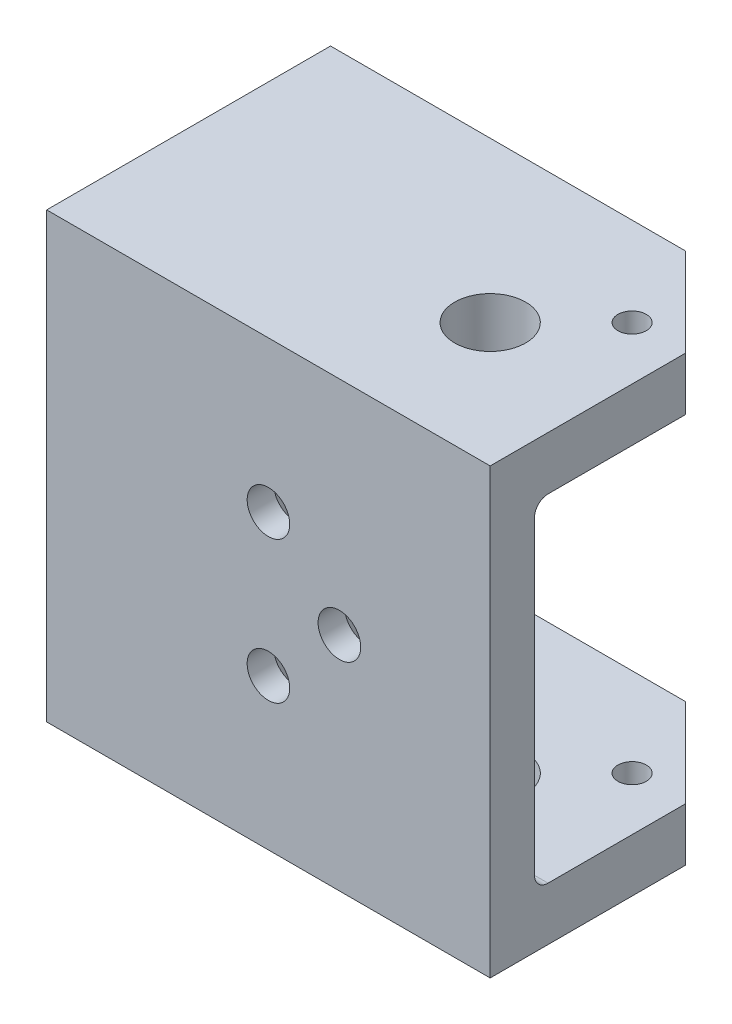
ISO-10303-21;
HEADER;
FILE_DESCRIPTION(('STEP AP214'),'2;1');
FILE_NAME('part.step','',(''),(''),'','','');
FILE_SCHEMA(('AUTOMOTIVE_DESIGN { 1 0 10303 214 1 1 1 1 }'));
ENDSEC;
DATA;
#1=APPLICATION_CONTEXT('core data for automotive mechanical design processes');
#2=APPLICATION_PROTOCOL_DEFINITION('international standard','automotive_design',2000,#1);
#3=PRODUCT_CONTEXT('',#1,'mechanical');
#4=PRODUCT('Part','Part','',(#3));
#5=PRODUCT_RELATED_PRODUCT_CATEGORY('part','',(#4));
#6=PRODUCT_DEFINITION_FORMATION('','',#4);
#7=PRODUCT_DEFINITION_CONTEXT('part definition',#1,'design');
#8=PRODUCT_DEFINITION('design','',#6,#7);
#9=PRODUCT_DEFINITION_SHAPE('','',#8);
#10=(LENGTH_UNIT() NAMED_UNIT(*) SI_UNIT(.MILLI.,.METRE.));
#11=(NAMED_UNIT(*) PLANE_ANGLE_UNIT() SI_UNIT($,.RADIAN.));
#12=(NAMED_UNIT(*) SI_UNIT($,.STERADIAN.) SOLID_ANGLE_UNIT());
#13=UNCERTAINTY_MEASURE_WITH_UNIT(LENGTH_MEASURE(1.E-05),#10,'distance_accuracy_value','');
#14=(GEOMETRIC_REPRESENTATION_CONTEXT(3) GLOBAL_UNCERTAINTY_ASSIGNED_CONTEXT((#13)) GLOBAL_UNIT_ASSIGNED_CONTEXT((#10,
#11,#12)) REPRESENTATION_CONTEXT('',''));
#15=CARTESIAN_POINT('',(0.,0.,0.));
#16=DIRECTION('',(0.,0.,1.));
#17=DIRECTION('',(1.,0.,0.));
#18=AXIS2_PLACEMENT_3D('',#15,#16,#17);
#19=CARTESIAN_POINT('',(0.,0.,0.));
#20=DIRECTION('',(0.,0.,1.));
#21=DIRECTION('',(1.,0.,0.));
#22=AXIS2_PLACEMENT_3D('',#19,#20,#21);
#23=PLANE('',#22);
#24=CARTESIAN_POINT('',(0.,4.,0.));
#25=DIRECTION('',(0.,0.,-1.));
#26=DIRECTION('',(-1.,0.,0.));
#27=AXIS2_PLACEMENT_3D('',#24,#25,#26);
#28=CIRCLE('',#27,2.2);
#29=CARTESIAN_POINT('',(-2.2,4.,0.));
#30=VERTEX_POINT('',#29);
#31=EDGE_CURVE('E294',#30,#30,#28,.T.);
#32=ORIENTED_EDGE('',*,*,#31,.F.);
#33=EDGE_LOOP('',(#32));
#34=FACE_BOUND('',#33,.T.);
#35=CARTESIAN_POINT('',(0.,-4.,0.));
#36=DIRECTION('',(0.,0.,-1.));
#37=DIRECTION('',(-1.,0.,0.));
#38=AXIS2_PLACEMENT_3D('',#35,#36,#37);
#39=CIRCLE('',#38,2.2);
#40=CARTESIAN_POINT('',(-2.2,-4.,0.));
#41=VERTEX_POINT('',#40);
#42=EDGE_CURVE('E285',#41,#41,#39,.T.);
#43=ORIENTED_EDGE('',*,*,#42,.F.);
#44=EDGE_LOOP('',(#43));
#45=FACE_BOUND('',#44,.T.);
#46=CARTESIAN_POINT('',(4.,0.,0.));
#47=DIRECTION('',(0.,0.,-1.));
#48=DIRECTION('',(-1.,0.,0.));
#49=AXIS2_PLACEMENT_3D('',#46,#47,#48);
#50=CIRCLE('',#49,2.2);
#51=CARTESIAN_POINT('',(1.8,0.,0.));
#52=VERTEX_POINT('',#51);
#53=EDGE_CURVE('E276',#52,#52,#50,.T.);
#54=ORIENTED_EDGE('',*,*,#53,.F.);
#55=EDGE_LOOP('',(#54));
#56=FACE_BOUND('',#55,.T.);
#57=DIRECTION('',(0.,-1.,0.));
#58=VECTOR('',#57,1.);
#59=CARTESIAN_POINT('',(-12.5,12.5,0.));
#60=LINE('',#59,#58);
#61=CARTESIAN_POINT('',(-12.5,8.738,0.));
#62=VERTEX_POINT('',#61);
#63=CARTESIAN_POINT('',(-12.5,-8.738,0.));
#64=VERTEX_POINT('',#63);
#65=EDGE_CURVE('E175',#62,#64,#60,.T.);
#66=ORIENTED_EDGE('',*,*,#65,.F.);
#67=DIRECTION('',(-1.,0.,0.));
#68=VECTOR('',#67,1.);
#69=CARTESIAN_POINT('',(12.5,8.738,0.));
#70=LINE('',#69,#68);
#71=CARTESIAN_POINT('',(12.5,8.738,0.));
#72=VERTEX_POINT('',#71);
#73=EDGE_CURVE('E207',#62,#72,#70,.F.);
#74=ORIENTED_EDGE('',*,*,#73,.T.);
#75=DIRECTION('',(0.,1.,0.));
#76=VECTOR('',#75,1.);
#77=CARTESIAN_POINT('',(12.5,12.5,0.));
#78=LINE('',#77,#76);
#79=CARTESIAN_POINT('',(12.5,-8.73800000000001,0.));
#80=VERTEX_POINT('',#79);
#81=EDGE_CURVE('E170',#80,#72,#78,.T.);
#82=ORIENTED_EDGE('',*,*,#81,.F.);
#83=DIRECTION('',(1.,0.,0.));
#84=VECTOR('',#83,1.);
#85=CARTESIAN_POINT('',(-12.5,-8.738,0.));
#86=LINE('',#85,#84);
#87=EDGE_CURVE('E205',#80,#64,#86,.F.);
#88=ORIENTED_EDGE('',*,*,#87,.T.);
#89=EDGE_LOOP('',(#66,#74,#82,#88));
#90=FACE_BOUND('',#89,.T.);
#91=ADVANCED_FACE('F35',(#34,#45,#56,#90),#23,.F.);
#92=CARTESIAN_POINT('',(12.5,12.5,2.5));
#93=DIRECTION('',(-1.,0.,0.));
#94=DIRECTION('',(0.,-1.,0.));
#95=AXIS2_PLACEMENT_3D('',#92,#93,#94);
#96=PLANE('',#95);
#97=DIRECTION('',(0.,0.,-1.));
#98=VECTOR('',#97,1.);
#99=CARTESIAN_POINT('',(12.5,-12.5,2.5));
#100=LINE('',#99,#98);
#101=CARTESIAN_POINT('',(12.5,-12.5,2.5));
#102=VERTEX_POINT('',#101);
#103=CARTESIAN_POINT('',(12.5,-12.5,-8.49999999999998));
#104=VERTEX_POINT('',#103);
#105=EDGE_CURVE('E181',#102,#104,#100,.T.);
#106=ORIENTED_EDGE('',*,*,#105,.T.);
#107=DIRECTION('',(0.,1.,0.));
#108=VECTOR('',#107,1.);
#109=CARTESIAN_POINT('',(12.5,-9.50000000000001,-8.49999999999998));
#110=LINE('',#109,#108);
#111=CARTESIAN_POINT('',(12.5,-9.50000000000001,-8.49999999999998));
#112=VERTEX_POINT('',#111);
#113=EDGE_CURVE('E225',#104,#112,#110,.T.);
#114=ORIENTED_EDGE('',*,*,#113,.T.);
#115=DIRECTION('',(0.,0.,1.));
#116=VECTOR('',#115,1.);
#117=CARTESIAN_POINT('',(12.5,-9.50000000000001,-13.5));
#118=LINE('',#117,#116);
#119=CARTESIAN_POINT('',(12.5,-9.50000000000001,-0.762000000000001));
#120=VERTEX_POINT('',#119);
#121=EDGE_CURVE('E154',#112,#120,#118,.T.);
#122=ORIENTED_EDGE('',*,*,#121,.T.);
#123=CARTESIAN_POINT('',(12.5,-8.738,-0.762000000000001));
#124=DIRECTION('',(-1.,0.,0.));
#125=DIRECTION('',(0.,-1.,0.));
#126=AXIS2_PLACEMENT_3D('',#123,#124,#125);
#127=CIRCLE('',#126,0.762);
#128=EDGE_CURVE('E216',#120,#80,#127,.T.);
#129=ORIENTED_EDGE('',*,*,#128,.T.);
#130=ORIENTED_EDGE('',*,*,#81,.T.);
#131=CARTESIAN_POINT('',(12.5,8.738,-0.762000000000001));
#132=DIRECTION('',(-1.,0.,0.));
#133=DIRECTION('',(0.,-1.,0.));
#134=AXIS2_PLACEMENT_3D('',#131,#132,#133);
#135=CIRCLE('',#134,0.762);
#136=CARTESIAN_POINT('',(12.5,9.5,-0.762000000000001));
#137=VERTEX_POINT('',#136);
#138=EDGE_CURVE('E213',#72,#137,#135,.T.);
#139=ORIENTED_EDGE('',*,*,#138,.T.);
#140=DIRECTION('',(0.,0.,1.));
#141=VECTOR('',#140,1.);
#142=CARTESIAN_POINT('',(12.5,9.5,-13.5));
#143=LINE('',#142,#141);
#144=CARTESIAN_POINT('',(12.5,9.5,-8.49999999999998));
#145=VERTEX_POINT('',#144);
#146=EDGE_CURVE('E168',#145,#137,#143,.T.);
#147=ORIENTED_EDGE('',*,*,#146,.F.);
#148=DIRECTION('',(0.,1.,0.));
#149=VECTOR('',#148,1.);
#150=CARTESIAN_POINT('',(12.5,12.5,-8.49999999999998));
#151=LINE('',#150,#149);
#152=CARTESIAN_POINT('',(12.5,12.5,-8.49999999999998));
#153=VERTEX_POINT('',#152);
#154=EDGE_CURVE('E223',#145,#153,#151,.T.);
#155=ORIENTED_EDGE('',*,*,#154,.T.);
#156=DIRECTION('',(0.,0.,-1.));
#157=VECTOR('',#156,1.);
#158=CARTESIAN_POINT('',(12.5,12.5,2.5));
#159=LINE('',#158,#157);
#160=CARTESIAN_POINT('',(12.5,12.5,2.5));
#161=VERTEX_POINT('',#160);
#162=EDGE_CURVE('E191',#161,#153,#159,.T.);
#163=ORIENTED_EDGE('',*,*,#162,.F.);
#164=DIRECTION('',(0.,1.,0.));
#165=VECTOR('',#164,1.);
#166=CARTESIAN_POINT('',(12.5,12.5,2.5));
#167=LINE('',#166,#165);
#168=EDGE_CURVE('E171',#102,#161,#167,.T.);
#169=ORIENTED_EDGE('',*,*,#168,.F.);
#170=EDGE_LOOP('',(#106,#114,#122,#129,#130,#139,#147,#155,#163,#169));
#171=FACE_BOUND('',#170,.T.);
#172=ADVANCED_FACE('F235',(#171),#96,.F.);
#173=CARTESIAN_POINT('',(-12.5,12.5,2.5));
#174=DIRECTION('',(0.,-1.,0.));
#175=DIRECTION('',(0.,0.,-1.));
#176=AXIS2_PLACEMENT_3D('',#173,#174,#175);
#177=PLANE('',#176);
#178=CARTESIAN_POINT('',(9.5,12.5,-8.5));
#179=DIRECTION('',(0.,-1.,0.));
#180=DIRECTION('',(0.,0.,-1.));
#181=AXIS2_PLACEMENT_3D('',#178,#179,#180);
#182=CIRCLE('',#181,0.800000000000001);
#183=CARTESIAN_POINT('',(9.5,12.5,-9.3));
#184=VERTEX_POINT('',#183);
#185=EDGE_CURVE('E202',#184,#184,#182,.T.);
#186=ORIENTED_EDGE('',*,*,#185,.T.);
#187=EDGE_LOOP('',(#186));
#188=FACE_BOUND('',#187,.T.);
#189=CARTESIAN_POINT('',(5.5,12.5,-4.5));
#190=DIRECTION('',(0.,-1.,0.));
#191=DIRECTION('',(0.,0.,-1.));
#192=AXIS2_PLACEMENT_3D('',#189,#190,#191);
#193=CIRCLE('',#192,2.);
#194=CARTESIAN_POINT('',(5.5,12.5,-6.5));
#195=VERTEX_POINT('',#194);
#196=EDGE_CURVE('E197',#195,#195,#193,.T.);
#197=ORIENTED_EDGE('',*,*,#196,.T.);
#198=EDGE_LOOP('',(#197));
#199=FACE_BOUND('',#198,.T.);
#200=ORIENTED_EDGE('',*,*,#162,.T.);
#201=DIRECTION('',(0.707106781186546,0.,0.707106781186549));
#202=VECTOR('',#201,1.);
#203=CARTESIAN_POINT('',(7.49999999999999,12.5,-13.5));
#204=LINE('',#203,#202);
#205=CARTESIAN_POINT('',(7.49999999999999,12.5,-13.5));
#206=VERTEX_POINT('',#205);
#207=EDGE_CURVE('E11',#153,#206,#204,.F.);
#208=ORIENTED_EDGE('',*,*,#207,.T.);
#209=DIRECTION('',(1.,0.,0.));
#210=VECTOR('',#209,1.);
#211=CARTESIAN_POINT('',(-12.5,12.5,-13.5));
#212=LINE('',#211,#210);
#213=CARTESIAN_POINT('',(-12.5,12.5,-13.5));
#214=VERTEX_POINT('',#213);
#215=EDGE_CURVE('E157',#214,#206,#212,.T.);
#216=ORIENTED_EDGE('',*,*,#215,.F.);
#217=DIRECTION('',(0.,0.,-1.));
#218=VECTOR('',#217,1.);
#219=CARTESIAN_POINT('',(-12.5,12.5,2.5));
#220=LINE('',#219,#218);
#221=CARTESIAN_POINT('',(-12.5,12.5,2.5));
#222=VERTEX_POINT('',#221);
#223=EDGE_CURVE('E189',#222,#214,#220,.T.);
#224=ORIENTED_EDGE('',*,*,#223,.F.);
#225=DIRECTION('',(-1.,0.,0.));
#226=VECTOR('',#225,1.);
#227=CARTESIAN_POINT('',(-12.5,12.5,2.5));
#228=LINE('',#227,#226);
#229=EDGE_CURVE('E174',#161,#222,#228,.T.);
#230=ORIENTED_EDGE('',*,*,#229,.F.);
#231=EDGE_LOOP('',(#200,#208,#216,#224,#230));
#232=FACE_BOUND('',#231,.T.);
#233=ADVANCED_FACE('F243',(#188,#199,#232),#177,.F.);
#234=CARTESIAN_POINT('',(-12.5,12.5,2.5));
#235=DIRECTION('',(1.,0.,0.));
#236=DIRECTION('',(0.,1.,0.));
#237=AXIS2_PLACEMENT_3D('',#234,#235,#236);
#238=PLANE('',#237);
#239=ORIENTED_EDGE('',*,*,#223,.T.);
#240=DIRECTION('',(0.,1.,0.));
#241=VECTOR('',#240,1.);
#242=CARTESIAN_POINT('',(-12.5,12.5,-13.5));
#243=LINE('',#242,#241);
#244=CARTESIAN_POINT('',(-12.5,9.5,-13.5));
#245=VERTEX_POINT('',#244);
#246=EDGE_CURVE('E153',#245,#214,#243,.T.);
#247=ORIENTED_EDGE('',*,*,#246,.F.);
#248=DIRECTION('',(0.,0.,1.));
#249=VECTOR('',#248,1.);
#250=CARTESIAN_POINT('',(-12.5,9.5,-13.5));
#251=LINE('',#250,#249);
#252=CARTESIAN_POINT('',(-12.5,9.5,-0.762000000000001));
#253=VERTEX_POINT('',#252);
#254=EDGE_CURVE('E165',#245,#253,#251,.T.);
#255=ORIENTED_EDGE('',*,*,#254,.T.);
#256=CARTESIAN_POINT('',(-12.5,8.738,-0.762000000000001));
#257=DIRECTION('',(1.,0.,0.));
#258=DIRECTION('',(0.,1.,0.));
#259=AXIS2_PLACEMENT_3D('',#256,#257,#258);
#260=CIRCLE('',#259,0.762);
#261=EDGE_CURVE('E211',#253,#62,#260,.T.);
#262=ORIENTED_EDGE('',*,*,#261,.T.);
#263=ORIENTED_EDGE('',*,*,#65,.T.);
#264=CARTESIAN_POINT('',(-12.5,-8.738,-0.762000000000001));
#265=DIRECTION('',(1.,0.,0.));
#266=DIRECTION('',(0.,1.,0.));
#267=AXIS2_PLACEMENT_3D('',#264,#265,#266);
#268=CIRCLE('',#267,0.762);
#269=CARTESIAN_POINT('',(-12.5,-9.5,-0.762000000000001));
#270=VERTEX_POINT('',#269);
#271=EDGE_CURVE('E152',#64,#270,#268,.T.);
#272=ORIENTED_EDGE('',*,*,#271,.T.);
#273=DIRECTION('',(0.,0.,1.));
#274=VECTOR('',#273,1.);
#275=CARTESIAN_POINT('',(-12.5,-9.5,-13.5));
#276=LINE('',#275,#274);
#277=CARTESIAN_POINT('',(-12.5,-9.5,-13.5));
#278=VERTEX_POINT('',#277);
#279=EDGE_CURVE('E131',#278,#270,#276,.T.);
#280=ORIENTED_EDGE('',*,*,#279,.F.);
#281=DIRECTION('',(0.,1.,0.));
#282=VECTOR('',#281,1.);
#283=CARTESIAN_POINT('',(-12.5,-12.5,-13.5));
#284=LINE('',#283,#282);
#285=CARTESIAN_POINT('',(-12.5,-12.5,-13.5));
#286=VERTEX_POINT('',#285);
#287=EDGE_CURVE('E139',#286,#278,#284,.T.);
#288=ORIENTED_EDGE('',*,*,#287,.F.);
#289=DIRECTION('',(0.,0.,-1.));
#290=VECTOR('',#289,1.);
#291=CARTESIAN_POINT('',(-12.5,-12.5,2.5));
#292=LINE('',#291,#290);
#293=CARTESIAN_POINT('',(-12.5,-12.5,2.5));
#294=VERTEX_POINT('',#293);
#295=EDGE_CURVE('E187',#294,#286,#292,.T.);
#296=ORIENTED_EDGE('',*,*,#295,.F.);
#297=DIRECTION('',(0.,-1.,0.));
#298=VECTOR('',#297,1.);
#299=CARTESIAN_POINT('',(-12.5,12.5,2.5));
#300=LINE('',#299,#298);
#301=EDGE_CURVE('E177',#222,#294,#300,.T.);
#302=ORIENTED_EDGE('',*,*,#301,.F.);
#303=EDGE_LOOP('',(#239,#247,#255,#262,#263,#272,#280,#288,#296,#302));
#304=FACE_BOUND('',#303,.T.);
#305=ADVANCED_FACE('F149',(#304),#238,.F.);
#306=CARTESIAN_POINT('',(-12.5,-12.5,2.5));
#307=DIRECTION('',(0.,1.,0.));
#308=DIRECTION('',(0.,0.,1.));
#309=AXIS2_PLACEMENT_3D('',#306,#307,#308);
#310=PLANE('',#309);
#311=CARTESIAN_POINT('',(9.5,-12.5,-8.5));
#312=DIRECTION('',(0.,-1.,0.));
#313=DIRECTION('',(0.,0.,-1.));
#314=AXIS2_PLACEMENT_3D('',#311,#312,#313);
#315=CIRCLE('',#314,0.800000000000001);
#316=CARTESIAN_POINT('',(9.5,-12.5,-9.3));
#317=VERTEX_POINT('',#316);
#318=EDGE_CURVE('E265',#317,#317,#315,.T.);
#319=ORIENTED_EDGE('',*,*,#318,.F.);
#320=EDGE_LOOP('',(#319));
#321=FACE_BOUND('',#320,.T.);
#322=CARTESIAN_POINT('',(5.5,-12.5,-4.5));
#323=DIRECTION('',(0.,-1.,0.));
#324=DIRECTION('',(0.,0.,-1.));
#325=AXIS2_PLACEMENT_3D('',#322,#323,#324);
#326=CIRCLE('',#325,2.);
#327=CARTESIAN_POINT('',(5.5,-12.5,-6.5));
#328=VERTEX_POINT('',#327);
#329=EDGE_CURVE('E258',#328,#328,#326,.T.);
#330=ORIENTED_EDGE('',*,*,#329,.F.);
#331=EDGE_LOOP('',(#330));
#332=FACE_BOUND('',#331,.T.);
#333=DIRECTION('',(-1.,0.,0.));
#334=VECTOR('',#333,1.);
#335=CARTESIAN_POINT('',(-12.5,-12.5,-13.5));
#336=LINE('',#335,#334);
#337=CARTESIAN_POINT('',(7.5,-12.5,-13.5));
#338=VERTEX_POINT('',#337);
#339=EDGE_CURVE('E138',#338,#286,#336,.T.);
#340=ORIENTED_EDGE('',*,*,#339,.F.);
#341=DIRECTION('',(0.707106781186546,0.,0.707106781186549));
#342=VECTOR('',#341,1.);
#343=CARTESIAN_POINT('',(7.5,-12.5,-13.5));
#344=LINE('',#343,#342);
#345=EDGE_CURVE('E221',#338,#104,#344,.T.);
#346=ORIENTED_EDGE('',*,*,#345,.T.);
#347=ORIENTED_EDGE('',*,*,#105,.F.);
#348=DIRECTION('',(1.,0.,0.));
#349=VECTOR('',#348,1.);
#350=CARTESIAN_POINT('',(-12.5,-12.5,2.5));
#351=LINE('',#350,#349);
#352=EDGE_CURVE('E179',#294,#102,#351,.T.);
#353=ORIENTED_EDGE('',*,*,#352,.F.);
#354=ORIENTED_EDGE('',*,*,#295,.T.);
#355=EDGE_LOOP('',(#340,#346,#347,#353,#354));
#356=FACE_BOUND('',#355,.T.);
#357=ADVANCED_FACE('F254',(#321,#332,#356),#310,.F.);
#358=CARTESIAN_POINT('',(0.,0.,2.5));
#359=DIRECTION('',(0.,0.,1.));
#360=DIRECTION('',(1.,0.,0.));
#361=AXIS2_PLACEMENT_3D('',#358,#359,#360);
#362=PLANE('',#361);
#363=CARTESIAN_POINT('',(0.,4.,2.5));
#364=DIRECTION('',(0.,0.,-1.));
#365=DIRECTION('',(-1.,0.,0.));
#366=AXIS2_PLACEMENT_3D('',#363,#364,#365);
#367=CIRCLE('',#366,1.2);
#368=CARTESIAN_POINT('',(-1.2,4.,2.5));
#369=VERTEX_POINT('',#368);
#370=EDGE_CURVE('E288',#369,#369,#367,.T.);
#371=ORIENTED_EDGE('',*,*,#370,.T.);
#372=EDGE_LOOP('',(#371));
#373=FACE_BOUND('',#372,.T.);
#374=CARTESIAN_POINT('',(0.,-4.,2.5));
#375=DIRECTION('',(0.,0.,-1.));
#376=DIRECTION('',(-1.,0.,0.));
#377=AXIS2_PLACEMENT_3D('',#374,#375,#376);
#378=CIRCLE('',#377,1.2);
#379=CARTESIAN_POINT('',(-1.2,-4.,2.5));
#380=VERTEX_POINT('',#379);
#381=EDGE_CURVE('E279',#380,#380,#378,.T.);
#382=ORIENTED_EDGE('',*,*,#381,.T.);
#383=EDGE_LOOP('',(#382));
#384=FACE_BOUND('',#383,.T.);
#385=CARTESIAN_POINT('',(4.,0.,2.5));
#386=DIRECTION('',(0.,0.,-1.));
#387=DIRECTION('',(-1.,0.,0.));
#388=AXIS2_PLACEMENT_3D('',#385,#386,#387);
#389=CIRCLE('',#388,1.2);
#390=CARTESIAN_POINT('',(2.8,0.,2.5));
#391=VERTEX_POINT('',#390);
#392=EDGE_CURVE('E268',#391,#391,#389,.T.);
#393=ORIENTED_EDGE('',*,*,#392,.T.);
#394=EDGE_LOOP('',(#393));
#395=FACE_BOUND('',#394,.T.);
#396=ORIENTED_EDGE('',*,*,#168,.T.);
#397=ORIENTED_EDGE('',*,*,#229,.T.);
#398=ORIENTED_EDGE('',*,*,#301,.T.);
#399=ORIENTED_EDGE('',*,*,#352,.T.);
#400=EDGE_LOOP('',(#396,#397,#398,#399));
#401=FACE_BOUND('',#400,.T.);
#402=ADVANCED_FACE('F247',(#373,#384,#395,#401),#362,.T.);
#403=CARTESIAN_POINT('',(-12.5,9.5,-13.5));
#404=DIRECTION('',(0.,1.,0.));
#405=DIRECTION('',(-1.,0.,0.));
#406=AXIS2_PLACEMENT_3D('',#403,#404,#405);
#407=PLANE('',#406);
#408=CARTESIAN_POINT('',(9.5,9.5,-8.5));
#409=DIRECTION('',(0.,1.,0.));
#410=DIRECTION('',(-1.,0.,0.));
#411=AXIS2_PLACEMENT_3D('',#408,#409,#410);
#412=CIRCLE('',#411,0.800000000000001);
#413=CARTESIAN_POINT('',(8.7,9.5,-8.5));
#414=VERTEX_POINT('',#413);
#415=EDGE_CURVE('E201',#414,#414,#412,.T.);
#416=ORIENTED_EDGE('',*,*,#415,.T.);
#417=EDGE_LOOP('',(#416));
#418=FACE_BOUND('',#417,.T.);
#419=CARTESIAN_POINT('',(5.5,9.5,-4.5));
#420=DIRECTION('',(0.,1.,0.));
#421=DIRECTION('',(-1.,0.,0.));
#422=AXIS2_PLACEMENT_3D('',#419,#420,#421);
#423=CIRCLE('',#422,2.);
#424=CARTESIAN_POINT('',(3.5,9.5,-4.5));
#425=VERTEX_POINT('',#424);
#426=EDGE_CURVE('E147',#425,#425,#423,.T.);
#427=ORIENTED_EDGE('',*,*,#426,.T.);
#428=EDGE_LOOP('',(#427));
#429=FACE_BOUND('',#428,.T.);
#430=DIRECTION('',(-1.,0.,0.));
#431=VECTOR('',#430,1.);
#432=CARTESIAN_POINT('',(-12.5,9.5,-13.5));
#433=LINE('',#432,#431);
#434=CARTESIAN_POINT('',(7.49999999999998,9.5,-13.5));
#435=VERTEX_POINT('',#434);
#436=EDGE_CURVE('E163',#435,#245,#433,.T.);
#437=ORIENTED_EDGE('',*,*,#436,.F.);
#438=DIRECTION('',(-0.707106781186546,0.,-0.707106781186549));
#439=VECTOR('',#438,1.);
#440=CARTESIAN_POINT('',(7.49999999999999,9.5,-13.5));
#441=LINE('',#440,#439);
#442=EDGE_CURVE('E44',#435,#145,#441,.F.);
#443=ORIENTED_EDGE('',*,*,#442,.T.);
#444=ORIENTED_EDGE('',*,*,#146,.T.);
#445=DIRECTION('',(-1.,0.,0.));
#446=VECTOR('',#445,1.);
#447=CARTESIAN_POINT('',(-12.5,9.5,-0.762000000000001));
#448=LINE('',#447,#446);
#449=EDGE_CURVE('E193',#137,#253,#448,.T.);
#450=ORIENTED_EDGE('',*,*,#449,.T.);
#451=ORIENTED_EDGE('',*,*,#254,.F.);
#452=EDGE_LOOP('',(#437,#443,#444,#450,#451));
#453=FACE_BOUND('',#452,.T.);
#454=ADVANCED_FACE('F232',(#418,#429,#453),#407,.F.);
#455=CARTESIAN_POINT('',(0.,0.,-13.5));
#456=DIRECTION('',(0.,0.,1.));
#457=DIRECTION('',(1.,0.,0.));
#458=AXIS2_PLACEMENT_3D('',#455,#456,#457);
#459=PLANE('',#458);
#460=ORIENTED_EDGE('',*,*,#215,.T.);
#461=DIRECTION('',(0.,-1.,0.));
#462=VECTOR('',#461,1.);
#463=CARTESIAN_POINT('',(7.49999999999999,0.,-13.5));
#464=LINE('',#463,#462);
#465=EDGE_CURVE('E228',#206,#435,#464,.T.);
#466=ORIENTED_EDGE('',*,*,#465,.T.);
#467=ORIENTED_EDGE('',*,*,#436,.T.);
#468=ORIENTED_EDGE('',*,*,#246,.T.);
#469=EDGE_LOOP('',(#460,#466,#467,#468));
#470=FACE_BOUND('',#469,.T.);
#471=ADVANCED_FACE('F240',(#470),#459,.F.);
#472=CARTESIAN_POINT('',(-12.5,-9.5,-13.5));
#473=DIRECTION('',(0.,-1.,0.));
#474=DIRECTION('',(1.,0.,0.));
#475=AXIS2_PLACEMENT_3D('',#472,#473,#474);
#476=PLANE('',#475);
#477=CARTESIAN_POINT('',(9.5,-9.50000000000001,-8.5));
#478=DIRECTION('',(0.,-1.,0.));
#479=DIRECTION('',(1.,0.,0.));
#480=AXIS2_PLACEMENT_3D('',#477,#478,#479);
#481=CIRCLE('',#480,0.800000000000001);
#482=CARTESIAN_POINT('',(10.3,-9.50000000000001,-8.5));
#483=VERTEX_POINT('',#482);
#484=EDGE_CURVE('E198',#483,#483,#481,.T.);
#485=ORIENTED_EDGE('',*,*,#484,.T.);
#486=EDGE_LOOP('',(#485));
#487=FACE_BOUND('',#486,.T.);
#488=CARTESIAN_POINT('',(5.5,-9.50000000000001,-4.5));
#489=DIRECTION('',(0.,-1.,0.));
#490=DIRECTION('',(1.,0.,0.));
#491=AXIS2_PLACEMENT_3D('',#488,#489,#490);
#492=CIRCLE('',#491,2.);
#493=CARTESIAN_POINT('',(7.5,-9.50000000000001,-4.5));
#494=VERTEX_POINT('',#493);
#495=EDGE_CURVE('E194',#494,#494,#492,.T.);
#496=ORIENTED_EDGE('',*,*,#495,.T.);
#497=EDGE_LOOP('',(#496));
#498=FACE_BOUND('',#497,.T.);
#499=ORIENTED_EDGE('',*,*,#121,.F.);
#500=DIRECTION('',(-0.707106781186546,0.,-0.707106781186549));
#501=VECTOR('',#500,1.);
#502=CARTESIAN_POINT('',(7.49999999999999,-9.50000000000001,-13.5));
#503=LINE('',#502,#501);
#504=CARTESIAN_POINT('',(7.49999999999999,-9.50000000000001,-13.5));
#505=VERTEX_POINT('',#504);
#506=EDGE_CURVE('E134',#112,#505,#503,.T.);
#507=ORIENTED_EDGE('',*,*,#506,.T.);
#508=DIRECTION('',(1.,0.,0.));
#509=VECTOR('',#508,1.);
#510=CARTESIAN_POINT('',(-12.5,-9.5,-13.5));
#511=LINE('',#510,#509);
#512=EDGE_CURVE('E125',#278,#505,#511,.T.);
#513=ORIENTED_EDGE('',*,*,#512,.F.);
#514=ORIENTED_EDGE('',*,*,#279,.T.);
#515=DIRECTION('',(1.,0.,0.));
#516=VECTOR('',#515,1.);
#517=CARTESIAN_POINT('',(12.5,-9.50000000000001,-0.762000000000001));
#518=LINE('',#517,#516);
#519=EDGE_CURVE('E209',#270,#120,#518,.T.);
#520=ORIENTED_EDGE('',*,*,#519,.T.);
#521=EDGE_LOOP('',(#499,#507,#513,#514,#520));
#522=FACE_BOUND('',#521,.T.);
#523=ADVANCED_FACE('F128',(#487,#498,#522),#476,.F.);
#524=CARTESIAN_POINT('',(0.,0.,-13.5));
#525=DIRECTION('',(0.,0.,-1.));
#526=DIRECTION('',(-1.,0.,0.));
#527=AXIS2_PLACEMENT_3D('',#524,#525,#526);
#528=PLANE('',#527);
#529=ORIENTED_EDGE('',*,*,#512,.T.);
#530=DIRECTION('',(0.,-1.,0.));
#531=VECTOR('',#530,1.);
#532=CARTESIAN_POINT('',(7.5,-12.5,-13.5));
#533=LINE('',#532,#531);
#534=EDGE_CURVE('E219',#505,#338,#533,.T.);
#535=ORIENTED_EDGE('',*,*,#534,.T.);
#536=ORIENTED_EDGE('',*,*,#339,.T.);
#537=ORIENTED_EDGE('',*,*,#287,.T.);
#538=EDGE_LOOP('',(#529,#535,#536,#537));
#539=FACE_BOUND('',#538,.T.);
#540=ADVANCED_FACE('F142',(#539),#528,.T.);
#541=CARTESIAN_POINT('',(5.5,12.5,-4.5));
#542=DIRECTION('',(0.,-1.,0.));
#543=DIRECTION('',(0.,0.,-1.));
#544=AXIS2_PLACEMENT_3D('',#541,#542,#543);
#545=CYLINDRICAL_SURFACE('',#544,2.);
#546=ORIENTED_EDGE('',*,*,#329,.T.);
#547=EDGE_LOOP('',(#546));
#548=FACE_BOUND('',#547,.T.);
#549=ORIENTED_EDGE('',*,*,#495,.F.);
#550=EDGE_LOOP('',(#549));
#551=FACE_BOUND('',#550,.T.);
#552=ADVANCED_FACE('F355',(#548,#551),#545,.F.);
#553=ORIENTED_EDGE('',*,*,#196,.F.);
#554=EDGE_LOOP('',(#553));
#555=FACE_BOUND('',#554,.T.);
#556=ORIENTED_EDGE('',*,*,#426,.F.);
#557=EDGE_LOOP('',(#556));
#558=FACE_BOUND('',#557,.T.);
#559=ADVANCED_FACE('F352',(#555,#558),#545,.F.);
#560=CARTESIAN_POINT('',(9.5,12.5,-8.5));
#561=DIRECTION('',(0.,-1.,0.));
#562=DIRECTION('',(0.,0.,-1.));
#563=AXIS2_PLACEMENT_3D('',#560,#561,#562);
#564=CYLINDRICAL_SURFACE('',#563,0.800000000000001);
#565=ORIENTED_EDGE('',*,*,#318,.T.);
#566=EDGE_LOOP('',(#565));
#567=FACE_BOUND('',#566,.T.);
#568=ORIENTED_EDGE('',*,*,#484,.F.);
#569=EDGE_LOOP('',(#568));
#570=FACE_BOUND('',#569,.T.);
#571=ADVANCED_FACE('F323',(#567,#570),#564,.F.);
#572=ORIENTED_EDGE('',*,*,#185,.F.);
#573=EDGE_LOOP('',(#572));
#574=FACE_BOUND('',#573,.T.);
#575=ORIENTED_EDGE('',*,*,#415,.F.);
#576=EDGE_LOOP('',(#575));
#577=FACE_BOUND('',#576,.T.);
#578=ADVANCED_FACE('F315',(#574,#577),#564,.F.);
#579=CARTESIAN_POINT('',(-12.5,8.738,-0.762000000000001));
#580=DIRECTION('',(1.,0.,0.));
#581=DIRECTION('',(0.,1.,0.));
#582=AXIS2_PLACEMENT_3D('',#579,#580,#581);
#583=CYLINDRICAL_SURFACE('',#582,0.762);
#584=ORIENTED_EDGE('',*,*,#138,.F.);
#585=ORIENTED_EDGE('',*,*,#73,.F.);
#586=ORIENTED_EDGE('',*,*,#261,.F.);
#587=ORIENTED_EDGE('',*,*,#449,.F.);
#588=EDGE_LOOP('',(#584,#585,#586,#587));
#589=FACE_BOUND('',#588,.T.);
#590=ADVANCED_FACE('F312',(#589),#583,.F.);
#591=CARTESIAN_POINT('',(-12.5,-8.738,-0.762000000000001));
#592=DIRECTION('',(-1.,0.,0.));
#593=DIRECTION('',(0.,-1.,0.));
#594=AXIS2_PLACEMENT_3D('',#591,#592,#593);
#595=CYLINDRICAL_SURFACE('',#594,0.762);
#596=ORIENTED_EDGE('',*,*,#271,.F.);
#597=ORIENTED_EDGE('',*,*,#87,.F.);
#598=ORIENTED_EDGE('',*,*,#128,.F.);
#599=ORIENTED_EDGE('',*,*,#519,.F.);
#600=EDGE_LOOP('',(#596,#597,#598,#599));
#601=FACE_BOUND('',#600,.T.);
#602=ADVANCED_FACE('F314',(#601),#595,.F.);
#603=CARTESIAN_POINT('',(7.49999999999999,0.,-13.5));
#604=DIRECTION('',(0.707106781186549,0.,-0.707106781186546));
#605=DIRECTION('',(0.,1.,0.));
#606=AXIS2_PLACEMENT_3D('',#603,#604,#605);
#607=PLANE('',#606);
#608=ORIENTED_EDGE('',*,*,#506,.F.);
#609=ORIENTED_EDGE('',*,*,#113,.F.);
#610=ORIENTED_EDGE('',*,*,#345,.F.);
#611=ORIENTED_EDGE('',*,*,#534,.F.);
#612=EDGE_LOOP('',(#608,#609,#610,#611));
#613=FACE_BOUND('',#612,.T.);
#614=ADVANCED_FACE('F253',(#613),#607,.T.);
#615=CARTESIAN_POINT('',(7.49999999999999,0.,-13.5));
#616=DIRECTION('',(-0.707106781186549,0.,0.707106781186546));
#617=DIRECTION('',(0.,-1.,0.));
#618=AXIS2_PLACEMENT_3D('',#615,#616,#617);
#619=PLANE('',#618);
#620=ORIENTED_EDGE('',*,*,#207,.F.);
#621=ORIENTED_EDGE('',*,*,#154,.F.);
#622=ORIENTED_EDGE('',*,*,#442,.F.);
#623=ORIENTED_EDGE('',*,*,#465,.F.);
#624=EDGE_LOOP('',(#620,#621,#622,#623));
#625=FACE_BOUND('',#624,.T.);
#626=ADVANCED_FACE('F38',(#625),#619,.F.);
#627=CARTESIAN_POINT('',(4.,0.,0.));
#628=DIRECTION('',(0.,0.,-1.));
#629=DIRECTION('',(-1.,0.,0.));
#630=AXIS2_PLACEMENT_3D('',#627,#628,#629);
#631=CYLINDRICAL_SURFACE('',#630,1.2);
#632=ORIENTED_EDGE('',*,*,#392,.F.);
#633=EDGE_LOOP('',(#632));
#634=FACE_BOUND('',#633,.T.);
#635=CARTESIAN_POINT('',(4.,0.,1.));
#636=DIRECTION('',(0.,0.,-1.));
#637=DIRECTION('',(-1.,0.,0.));
#638=AXIS2_PLACEMENT_3D('',#635,#636,#637);
#639=CIRCLE('',#638,1.2);
#640=CARTESIAN_POINT('',(2.8,0.,1.));
#641=VERTEX_POINT('',#640);
#642=EDGE_CURVE('E273',#641,#641,#639,.T.);
#643=ORIENTED_EDGE('',*,*,#642,.T.);
#644=EDGE_LOOP('',(#643));
#645=FACE_BOUND('',#644,.T.);
#646=ADVANCED_FACE('F335',(#634,#645),#631,.F.);
#647=CARTESIAN_POINT('',(4.,0.,0.));
#648=DIRECTION('',(0.,0.,-1.));
#649=DIRECTION('',(-1.,0.,0.));
#650=AXIS2_PLACEMENT_3D('',#647,#648,#649);
#651=CONICAL_SURFACE('',#650,2.2,0.785398163397449);
#652=ORIENTED_EDGE('',*,*,#642,.F.);
#653=EDGE_LOOP('',(#652));
#654=FACE_BOUND('',#653,.T.);
#655=ORIENTED_EDGE('',*,*,#53,.T.);
#656=EDGE_LOOP('',(#655));
#657=FACE_BOUND('',#656,.T.);
#658=ADVANCED_FACE('F339',(#654,#657),#651,.F.);
#659=CARTESIAN_POINT('',(0.,-4.,0.));
#660=DIRECTION('',(0.,0.,-1.));
#661=DIRECTION('',(-1.,0.,0.));
#662=AXIS2_PLACEMENT_3D('',#659,#660,#661);
#663=CYLINDRICAL_SURFACE('',#662,1.2);
#664=ORIENTED_EDGE('',*,*,#381,.F.);
#665=EDGE_LOOP('',(#664));
#666=FACE_BOUND('',#665,.T.);
#667=CARTESIAN_POINT('',(0.,-4.,1.));
#668=DIRECTION('',(0.,0.,-1.));
#669=DIRECTION('',(-1.,0.,0.));
#670=AXIS2_PLACEMENT_3D('',#667,#668,#669);
#671=CIRCLE('',#670,1.2);
#672=CARTESIAN_POINT('',(-1.2,-4.,1.));
#673=VERTEX_POINT('',#672);
#674=EDGE_CURVE('E282',#673,#673,#671,.T.);
#675=ORIENTED_EDGE('',*,*,#674,.T.);
#676=EDGE_LOOP('',(#675));
#677=FACE_BOUND('',#676,.T.);
#678=ADVANCED_FACE('F345',(#666,#677),#663,.F.);
#679=CARTESIAN_POINT('',(0.,-4.,0.));
#680=DIRECTION('',(0.,0.,-1.));
#681=DIRECTION('',(-1.,0.,0.));
#682=AXIS2_PLACEMENT_3D('',#679,#680,#681);
#683=CONICAL_SURFACE('',#682,2.2,0.785398163397449);
#684=ORIENTED_EDGE('',*,*,#674,.F.);
#685=EDGE_LOOP('',(#684));
#686=FACE_BOUND('',#685,.T.);
#687=ORIENTED_EDGE('',*,*,#42,.T.);
#688=EDGE_LOOP('',(#687));
#689=FACE_BOUND('',#688,.T.);
#690=ADVANCED_FACE('F423',(#686,#689),#683,.F.);
#691=CARTESIAN_POINT('',(0.,4.,0.));
#692=DIRECTION('',(0.,0.,-1.));
#693=DIRECTION('',(-1.,0.,0.));
#694=AXIS2_PLACEMENT_3D('',#691,#692,#693);
#695=CYLINDRICAL_SURFACE('',#694,1.2);
#696=ORIENTED_EDGE('',*,*,#370,.F.);
#697=EDGE_LOOP('',(#696));
#698=FACE_BOUND('',#697,.T.);
#699=CARTESIAN_POINT('',(0.,4.,1.));
#700=DIRECTION('',(0.,0.,-1.));
#701=DIRECTION('',(-1.,0.,0.));
#702=AXIS2_PLACEMENT_3D('',#699,#700,#701);
#703=CIRCLE('',#702,1.2);
#704=CARTESIAN_POINT('',(-1.2,4.,1.));
#705=VERTEX_POINT('',#704);
#706=EDGE_CURVE('E291',#705,#705,#703,.T.);
#707=ORIENTED_EDGE('',*,*,#706,.T.);
#708=EDGE_LOOP('',(#707));
#709=FACE_BOUND('',#708,.T.);
#710=ADVANCED_FACE('F432',(#698,#709),#695,.F.);
#711=CARTESIAN_POINT('',(0.,4.,0.));
#712=DIRECTION('',(0.,0.,-1.));
#713=DIRECTION('',(-1.,0.,0.));
#714=AXIS2_PLACEMENT_3D('',#711,#712,#713);
#715=CONICAL_SURFACE('',#714,2.2,0.785398163397449);
#716=ORIENTED_EDGE('',*,*,#706,.F.);
#717=EDGE_LOOP('',(#716));
#718=FACE_BOUND('',#717,.T.);
#719=ORIENTED_EDGE('',*,*,#31,.T.);
#720=EDGE_LOOP('',(#719));
#721=FACE_BOUND('',#720,.T.);
#722=ADVANCED_FACE('F298',(#718,#721),#715,.F.);
#723=CLOSED_SHELL('',(#91,#172,#233,#305,#357,#402,#454,#471,#523,#540,#552,#559,#571,#578,#590,
#602,#614,#626,#646,#658,#678,#690,#710,#722));
#724=MANIFOLD_SOLID_BREP('B2',#723);
#725=ADVANCED_BREP_SHAPE_REPRESENTATION('',(#18,#724),#14);
#726=SHAPE_DEFINITION_REPRESENTATION(#9,#725);
ENDSEC;
END-ISO-10303-21;
